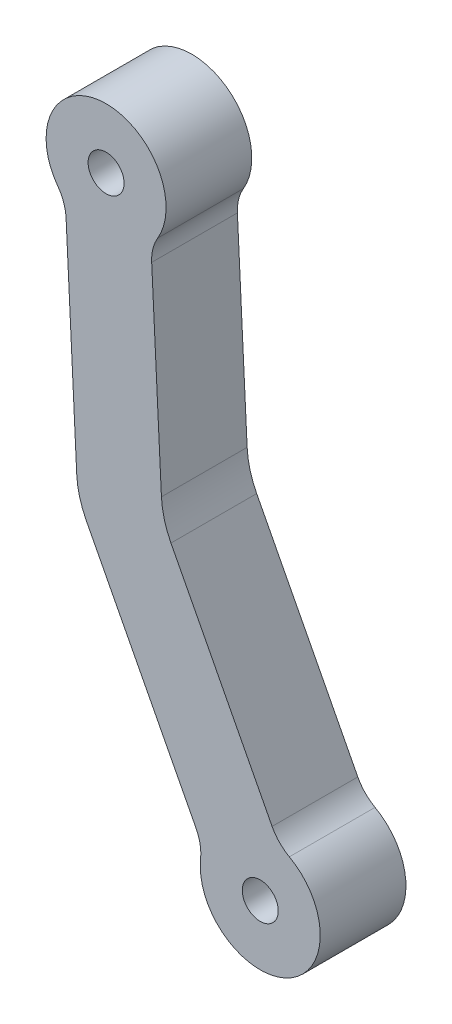
ISO-10303-21;
HEADER;
FILE_DESCRIPTION(('STEP AP214'),'2;1');
FILE_NAME('part.step','',(''),(''),'','','');
FILE_SCHEMA(('AUTOMOTIVE_DESIGN { 1 0 10303 214 1 1 1 1 }'));
ENDSEC;
DATA;
#1=APPLICATION_CONTEXT('core data for automotive mechanical design processes');
#2=APPLICATION_PROTOCOL_DEFINITION('international standard','automotive_design',2000,#1);
#3=PRODUCT_CONTEXT('',#1,'mechanical');
#4=PRODUCT('Part','Part','',(#3));
#5=PRODUCT_RELATED_PRODUCT_CATEGORY('part','',(#4));
#6=PRODUCT_DEFINITION_FORMATION('','',#4);
#7=PRODUCT_DEFINITION_CONTEXT('part definition',#1,'design');
#8=PRODUCT_DEFINITION('design','',#6,#7);
#9=PRODUCT_DEFINITION_SHAPE('','',#8);
#10=(LENGTH_UNIT() NAMED_UNIT(*) SI_UNIT(.MILLI.,.METRE.));
#11=(NAMED_UNIT(*) PLANE_ANGLE_UNIT() SI_UNIT($,.RADIAN.));
#12=(NAMED_UNIT(*) SI_UNIT($,.STERADIAN.) SOLID_ANGLE_UNIT());
#13=UNCERTAINTY_MEASURE_WITH_UNIT(LENGTH_MEASURE(1.E-05),#10,'distance_accuracy_value','');
#14=(GEOMETRIC_REPRESENTATION_CONTEXT(3) GLOBAL_UNCERTAINTY_ASSIGNED_CONTEXT((#13)) GLOBAL_UNIT_ASSIGNED_CONTEXT((#10,
#11,#12)) REPRESENTATION_CONTEXT('',''));
#15=CARTESIAN_POINT('',(0.,0.,0.));
#16=DIRECTION('',(0.,0.,1.));
#17=DIRECTION('',(1.,0.,0.));
#18=AXIS2_PLACEMENT_3D('',#15,#16,#17);
#19=CARTESIAN_POINT('',(-45.067,-17.7,10.));
#20=DIRECTION('',(0.,0.,1.));
#21=DIRECTION('',(1.,0.,0.));
#22=AXIS2_PLACEMENT_3D('',#19,#20,#21);
#23=PLANE('',#22);
#24=CARTESIAN_POINT('',(-45.067,-17.7,10.));
#25=DIRECTION('',(0.,0.,1.));
#26=DIRECTION('',(1.,0.,0.));
#27=AXIS2_PLACEMENT_3D('',#24,#25,#26);
#28=CIRCLE('',#27,2.1);
#29=CARTESIAN_POINT('',(-42.967,-17.7,10.));
#30=VERTEX_POINT('',#29);
#31=EDGE_CURVE('E162',#30,#30,#28,.T.);
#32=ORIENTED_EDGE('',*,*,#31,.F.);
#33=EDGE_LOOP('',(#32));
#34=FACE_BOUND('',#33,.T.);
#35=CARTESIAN_POINT('',(-45.067,-17.7,10.));
#36=DIRECTION('',(0.,0.,1.));
#37=DIRECTION('',(1.,0.,0.));
#38=AXIS2_PLACEMENT_3D('',#35,#36,#37);
#39=CIRCLE('',#38,6.99999999999999);
#40=CARTESIAN_POINT('',(-52.0270499023951,-16.9532032698453,10.));
#41=VERTEX_POINT('',#40);
#42=CARTESIAN_POINT('',(-41.6723017328103,-11.5782336148184,10.));
#43=VERTEX_POINT('',#42);
#44=EDGE_CURVE('E181',#41,#43,#39,.T.);
#45=ORIENTED_EDGE('',*,*,#44,.T.);
#46=CARTESIAN_POINT('',(-39.2475172562462,-7.20554333968861,10.));
#47=DIRECTION('',(0.,0.,-1.));
#48=DIRECTION('',(1.,0.,0.));
#49=AXIS2_PLACEMENT_3D('',#46,#47,#48);
#50=CIRCLE('',#49,5.00000000000009);
#51=CARTESIAN_POINT('',(-43.6852664812232,-9.50910185125652,10.));
#52=VERTEX_POINT('',#51);
#53=EDGE_CURVE('E109',#43,#52,#50,.T.);
#54=ORIENTED_EDGE('',*,*,#53,.T.);
#55=DIRECTION('',(-0.460711702313574,0.887549844995383,0.));
#56=VECTOR('',#55,1.);
#57=CARTESIAN_POINT('',(-43.6852664812232,-9.50910185125652,10.));
#58=LINE('',#57,#56);
#59=CARTESIAN_POINT('',(-55.4849486944537,13.2226978116472,10.));
#60=VERTEX_POINT('',#59);
#61=EDGE_CURVE('E208',#52,#60,#58,.T.);
#62=ORIENTED_EDGE('',*,*,#61,.T.);
#63=CARTESIAN_POINT('',(-46.6094502445001,17.8298148347829,10.));
#64=DIRECTION('',(0.,0.,-1.));
#65=DIRECTION('',(1.,0.,0.));
#66=AXIS2_PLACEMENT_3D('',#63,#64,#65);
#67=CIRCLE('',#66,9.99999999999982);
#68=CARTESIAN_POINT('',(-56.5973879653498,17.3387954009265,10.));
#69=VERTEX_POINT('',#68);
#70=EDGE_CURVE('E227',#60,#69,#67,.T.);
#71=ORIENTED_EDGE('',*,*,#70,.T.);
#72=DIRECTION('',(-0.0491019433856402,0.998793772084985,0.));
#73=VECTOR('',#72,1.);
#74=CARTESIAN_POINT('',(-56.5973879653498,17.3387954009265,10.));
#75=LINE('',#74,#73);
#76=CARTESIAN_POINT('',(-57.7340925822037,40.4607619409709,10.));
#77=VERTEX_POINT('',#76);
#78=EDGE_CURVE('E224',#69,#77,#75,.T.);
#79=ORIENTED_EDGE('',*,*,#78,.T.);
#80=CARTESIAN_POINT('',(-52.7401237217787,40.7062716578991,10.));
#81=DIRECTION('',(0.,0.,-1.));
#82=DIRECTION('',(1.,0.,0.));
#83=AXIS2_PLACEMENT_3D('',#80,#81,#82);
#84=CIRCLE('',#83,5.00000000000008);
#85=CARTESIAN_POINT('',(-57.0374750410391,43.2622003812503,10.));
#86=VERTEX_POINT('',#85);
#87=EDGE_CURVE('E226',#77,#86,#84,.T.);
#88=ORIENTED_EDGE('',*,*,#87,.T.);
#89=CARTESIAN_POINT('',(-63.0537668880036,46.8405005939419,10.));
#90=DIRECTION('',(0.,0.,1.));
#91=DIRECTION('',(1.,0.,0.));
#92=AXIS2_PLACEMENT_3D('',#89,#90,#91);
#93=CIRCLE('',#92,6.99999999999998);
#94=CARTESIAN_POINT('',(-68.6900692357354,42.6893446290386,10.));
#95=VERTEX_POINT('',#94);
#96=EDGE_CURVE('E229',#86,#95,#93,.T.);
#97=ORIENTED_EDGE('',*,*,#96,.T.);
#98=CARTESIAN_POINT('',(-72.7159991634786,39.7242327901862,10.));
#99=DIRECTION('',(0.,0.,-1.));
#100=DIRECTION('',(1.,0.,0.));
#101=AXIS2_PLACEMENT_3D('',#98,#99,#100);
#102=CIRCLE('',#101,5.00000000000009);
#103=CARTESIAN_POINT('',(-67.7220303030536,39.9697425071145,10.));
#104=VERTEX_POINT('',#103);
#105=EDGE_CURVE('E235',#95,#104,#102,.T.);
#106=ORIENTED_EDGE('',*,*,#105,.T.);
#107=DIRECTION('',(0.0491019433856435,-0.998793772084985,0.));
#108=VECTOR('',#107,1.);
#109=CARTESIAN_POINT('',(-67.7220303030536,39.9697425071145,10.));
#110=LINE('',#109,#108);
#111=CARTESIAN_POINT('',(-66.4781827515993,14.6683572226584,10.));
#112=VERTEX_POINT('',#111);
#113=EDGE_CURVE('E140',#104,#112,#110,.T.);
#114=ORIENTED_EDGE('',*,*,#113,.T.);
#115=CARTESIAN_POINT('',(-56.4902450307499,15.1593766565147,10.));
#116=DIRECTION('',(0.,0.,1.));
#117=DIRECTION('',(1.,0.,0.));
#118=AXIS2_PLACEMENT_3D('',#115,#116,#117);
#119=CIRCLE('',#118,9.99999999999954);
#120=CARTESIAN_POINT('',(-65.3657434807033,10.5522596333791,10.));
#121=VERTEX_POINT('',#120);
#122=EDGE_CURVE('E134',#112,#121,#119,.T.);
#123=ORIENTED_EDGE('',*,*,#122,.T.);
#124=DIRECTION('',(0.460711702313577,-0.887549844995381,0.));
#125=VECTOR('',#124,1.);
#126=CARTESIAN_POINT('',(-65.3657434807033,10.5522596333791,10.));
#127=LINE('',#126,#125);
#128=CARTESIAN_POINT('',(-52.560764931177,-14.1162188743923,10.));
#129=VERTEX_POINT('',#128);
#130=EDGE_CURVE('E138',#121,#129,#127,.T.);
#131=ORIENTED_EDGE('',*,*,#130,.T.);
#132=CARTESIAN_POINT('',(-56.9985141561539,-16.4197773859602,10.));
#133=DIRECTION('',(0.,0.,-1.));
#134=DIRECTION('',(1.,0.,0.));
#135=AXIS2_PLACEMENT_3D('',#132,#133,#134);
#136=CIRCLE('',#135,5.00000000000001);
#137=EDGE_CURVE('E54',#129,#41,#136,.T.);
#138=ORIENTED_EDGE('',*,*,#137,.T.);
#139=EDGE_LOOP('',(#45,#54,#62,#71,#79,#88,#97,#106,#114,#123,#131,#138));
#140=FACE_BOUND('',#139,.T.);
#141=CARTESIAN_POINT('',(-63.0537668880036,46.8405005939419,10.));
#142=DIRECTION('',(0.,0.,1.));
#143=DIRECTION('',(1.,0.,0.));
#144=AXIS2_PLACEMENT_3D('',#141,#142,#143);
#145=CIRCLE('',#144,2.1);
#146=CARTESIAN_POINT('',(-60.9537668880036,46.8405005939419,10.));
#147=VERTEX_POINT('',#146);
#148=EDGE_CURVE('E277',#147,#147,#145,.T.);
#149=ORIENTED_EDGE('',*,*,#148,.F.);
#150=EDGE_LOOP('',(#149));
#151=FACE_BOUND('',#150,.T.);
#152=ADVANCED_FACE('F37',(#34,#140,#151),#23,.T.);
#153=CARTESIAN_POINT('',(-45.067,-17.7,0.));
#154=DIRECTION('',(0.,0.,1.));
#155=DIRECTION('',(1.,0.,0.));
#156=AXIS2_PLACEMENT_3D('',#153,#154,#155);
#157=PLANE('',#156);
#158=CARTESIAN_POINT('',(-45.067,-17.7,0.));
#159=DIRECTION('',(0.,0.,1.));
#160=DIRECTION('',(1.,0.,0.));
#161=AXIS2_PLACEMENT_3D('',#158,#159,#160);
#162=CIRCLE('',#161,6.99999999999999);
#163=CARTESIAN_POINT('',(-52.0270499023951,-16.9532032698453,0.));
#164=VERTEX_POINT('',#163);
#165=CARTESIAN_POINT('',(-41.6723017328103,-11.5782336148184,0.));
#166=VERTEX_POINT('',#165);
#167=EDGE_CURVE('E158',#164,#166,#162,.T.);
#168=ORIENTED_EDGE('',*,*,#167,.F.);
#169=CARTESIAN_POINT('',(-56.9985141561539,-16.4197773859602,0.));
#170=DIRECTION('',(0.,0.,-1.));
#171=DIRECTION('',(1.,0.,0.));
#172=AXIS2_PLACEMENT_3D('',#169,#170,#171);
#173=CIRCLE('',#172,5.00000000000001);
#174=CARTESIAN_POINT('',(-52.560764931177,-14.1162188743923,0.));
#175=VERTEX_POINT('',#174);
#176=EDGE_CURVE('E101',#175,#164,#173,.T.);
#177=ORIENTED_EDGE('',*,*,#176,.F.);
#178=DIRECTION('',(0.460711702313577,-0.887549844995381,0.));
#179=VECTOR('',#178,1.);
#180=CARTESIAN_POINT('',(-65.3657434807033,10.5522596333791,0.));
#181=LINE('',#180,#179);
#182=CARTESIAN_POINT('',(-65.3657434807033,10.5522596333791,0.));
#183=VERTEX_POINT('',#182);
#184=EDGE_CURVE('E95',#183,#175,#181,.T.);
#185=ORIENTED_EDGE('',*,*,#184,.F.);
#186=CARTESIAN_POINT('',(-56.4902450307499,15.1593766565147,0.));
#187=DIRECTION('',(0.,0.,1.));
#188=DIRECTION('',(1.,0.,0.));
#189=AXIS2_PLACEMENT_3D('',#186,#187,#188);
#190=CIRCLE('',#189,9.99999999999954);
#191=CARTESIAN_POINT('',(-66.4781827515993,14.6683572226584,0.));
#192=VERTEX_POINT('',#191);
#193=EDGE_CURVE('E148',#192,#183,#190,.T.);
#194=ORIENTED_EDGE('',*,*,#193,.F.);
#195=DIRECTION('',(0.0491019433856435,-0.998793772084985,0.));
#196=VECTOR('',#195,1.);
#197=CARTESIAN_POINT('',(-67.7220303030536,39.9697425071145,0.));
#198=LINE('',#197,#196);
#199=CARTESIAN_POINT('',(-67.7220303030536,39.9697425071145,0.));
#200=VERTEX_POINT('',#199);
#201=EDGE_CURVE('E176',#200,#192,#198,.T.);
#202=ORIENTED_EDGE('',*,*,#201,.F.);
#203=CARTESIAN_POINT('',(-72.7159991634786,39.7242327901862,0.));
#204=DIRECTION('',(0.,0.,-1.));
#205=DIRECTION('',(1.,0.,0.));
#206=AXIS2_PLACEMENT_3D('',#203,#204,#205);
#207=CIRCLE('',#206,5.00000000000009);
#208=CARTESIAN_POINT('',(-68.6900692357354,42.6893446290386,0.));
#209=VERTEX_POINT('',#208);
#210=EDGE_CURVE('E174',#209,#200,#207,.T.);
#211=ORIENTED_EDGE('',*,*,#210,.F.);
#212=CARTESIAN_POINT('',(-63.0537668880036,46.8405005939419,0.));
#213=DIRECTION('',(0.,0.,1.));
#214=DIRECTION('',(1.,0.,0.));
#215=AXIS2_PLACEMENT_3D('',#212,#213,#214);
#216=CIRCLE('',#215,6.99999999999998);
#217=CARTESIAN_POINT('',(-57.0374750410391,43.2622003812503,0.));
#218=VERTEX_POINT('',#217);
#219=EDGE_CURVE('E172',#218,#209,#216,.T.);
#220=ORIENTED_EDGE('',*,*,#219,.F.);
#221=CARTESIAN_POINT('',(-52.7401237217787,40.7062716578991,0.));
#222=DIRECTION('',(0.,0.,-1.));
#223=DIRECTION('',(1.,0.,0.));
#224=AXIS2_PLACEMENT_3D('',#221,#222,#223);
#225=CIRCLE('',#224,5.00000000000008);
#226=CARTESIAN_POINT('',(-57.7340925822037,40.4607619409709,0.));
#227=VERTEX_POINT('',#226);
#228=EDGE_CURVE('E170',#227,#218,#225,.T.);
#229=ORIENTED_EDGE('',*,*,#228,.F.);
#230=DIRECTION('',(-0.0491019433856402,0.998793772084985,0.));
#231=VECTOR('',#230,1.);
#232=CARTESIAN_POINT('',(-56.5973879653498,17.3387954009265,0.));
#233=LINE('',#232,#231);
#234=CARTESIAN_POINT('',(-56.5973879653498,17.3387954009265,0.));
#235=VERTEX_POINT('',#234);
#236=EDGE_CURVE('E168',#235,#227,#233,.T.);
#237=ORIENTED_EDGE('',*,*,#236,.F.);
#238=CARTESIAN_POINT('',(-46.6094502445001,17.8298148347829,0.));
#239=DIRECTION('',(0.,0.,-1.));
#240=DIRECTION('',(1.,0.,0.));
#241=AXIS2_PLACEMENT_3D('',#238,#239,#240);
#242=CIRCLE('',#241,9.99999999999982);
#243=CARTESIAN_POINT('',(-55.4849486944537,13.2226978116472,0.));
#244=VERTEX_POINT('',#243);
#245=EDGE_CURVE('E166',#244,#235,#242,.T.);
#246=ORIENTED_EDGE('',*,*,#245,.F.);
#247=DIRECTION('',(-0.460711702313574,0.887549844995383,0.));
#248=VECTOR('',#247,1.);
#249=CARTESIAN_POINT('',(-43.6852664812232,-9.50910185125652,0.));
#250=LINE('',#249,#248);
#251=CARTESIAN_POINT('',(-43.6852664812232,-9.50910185125652,0.));
#252=VERTEX_POINT('',#251);
#253=EDGE_CURVE('E164',#252,#244,#250,.T.);
#254=ORIENTED_EDGE('',*,*,#253,.F.);
#255=CARTESIAN_POINT('',(-39.2475172562462,-7.20554333968861,0.));
#256=DIRECTION('',(0.,0.,-1.));
#257=DIRECTION('',(1.,0.,0.));
#258=AXIS2_PLACEMENT_3D('',#255,#256,#257);
#259=CIRCLE('',#258,5.00000000000009);
#260=EDGE_CURVE('E161',#166,#252,#259,.T.);
#261=ORIENTED_EDGE('',*,*,#260,.F.);
#262=EDGE_LOOP('',(#168,#177,#185,#194,#202,#211,#220,#229,#237,#246,#254,#261));
#263=FACE_BOUND('',#262,.T.);
#264=CARTESIAN_POINT('',(-45.067,-17.7,0.));
#265=DIRECTION('',(0.,0.,1.));
#266=DIRECTION('',(1.,0.,0.));
#267=AXIS2_PLACEMENT_3D('',#264,#265,#266);
#268=CIRCLE('',#267,2.1);
#269=CARTESIAN_POINT('',(-42.967,-17.7,0.));
#270=VERTEX_POINT('',#269);
#271=EDGE_CURVE('E283',#270,#270,#268,.T.);
#272=ORIENTED_EDGE('',*,*,#271,.T.);
#273=EDGE_LOOP('',(#272));
#274=FACE_BOUND('',#273,.T.);
#275=CARTESIAN_POINT('',(-63.0537668880036,46.8405005939419,0.));
#276=DIRECTION('',(0.,0.,1.));
#277=DIRECTION('',(1.,0.,0.));
#278=AXIS2_PLACEMENT_3D('',#275,#276,#277);
#279=CIRCLE('',#278,2.1);
#280=CARTESIAN_POINT('',(-60.9537668880036,46.8405005939419,0.));
#281=VERTEX_POINT('',#280);
#282=EDGE_CURVE('E280',#281,#281,#279,.T.);
#283=ORIENTED_EDGE('',*,*,#282,.T.);
#284=EDGE_LOOP('',(#283));
#285=FACE_BOUND('',#284,.T.);
#286=ADVANCED_FACE('F212',(#263,#274,#285),#157,.F.);
#287=CARTESIAN_POINT('',(-45.067,-17.7,10.));
#288=DIRECTION('',(0.,0.,-1.));
#289=DIRECTION('',(-1.,0.,0.));
#290=AXIS2_PLACEMENT_3D('',#287,#288,#289);
#291=CYLINDRICAL_SURFACE('',#290,6.99999999999999);
#292=ORIENTED_EDGE('',*,*,#167,.T.);
#293=DIRECTION('',(0.,0.,-1.));
#294=VECTOR('',#293,1.);
#295=CARTESIAN_POINT('',(-41.6723017328103,-11.5782336148184,10.));
#296=LINE('',#295,#294);
#297=EDGE_CURVE('E11',#43,#166,#296,.T.);
#298=ORIENTED_EDGE('',*,*,#297,.F.);
#299=ORIENTED_EDGE('',*,*,#44,.F.);
#300=DIRECTION('',(0.,0.,-1.));
#301=VECTOR('',#300,1.);
#302=CARTESIAN_POINT('',(-52.0270499023951,-16.9532032698453,10.));
#303=LINE('',#302,#301);
#304=EDGE_CURVE('E154',#41,#164,#303,.T.);
#305=ORIENTED_EDGE('',*,*,#304,.T.);
#306=EDGE_LOOP('',(#292,#298,#299,#305));
#307=FACE_BOUND('',#306,.T.);
#308=ADVANCED_FACE('F39',(#307),#291,.T.);
#309=CARTESIAN_POINT('',(-39.2475172562462,-7.20554333968861,10.));
#310=DIRECTION('',(0.,0.,-1.));
#311=DIRECTION('',(-1.,0.,0.));
#312=AXIS2_PLACEMENT_3D('',#309,#310,#311);
#313=CYLINDRICAL_SURFACE('',#312,5.00000000000009);
#314=ORIENTED_EDGE('',*,*,#260,.T.);
#315=DIRECTION('',(0.,0.,-1.));
#316=VECTOR('',#315,1.);
#317=CARTESIAN_POINT('',(-43.6852664812232,-9.50910185125652,10.));
#318=LINE('',#317,#316);
#319=EDGE_CURVE('E46',#52,#252,#318,.T.);
#320=ORIENTED_EDGE('',*,*,#319,.F.);
#321=ORIENTED_EDGE('',*,*,#53,.F.);
#322=ORIENTED_EDGE('',*,*,#297,.T.);
#323=EDGE_LOOP('',(#314,#320,#321,#322));
#324=FACE_BOUND('',#323,.T.);
#325=ADVANCED_FACE('F386',(#324),#313,.F.);
#326=CARTESIAN_POINT('',(-43.6852664812232,-9.50910185125652,10.));
#327=DIRECTION('',(-0.887549844995383,-0.460711702313574,0.));
#328=DIRECTION('',(0.460711702313574,-0.887549844995383,0.));
#329=AXIS2_PLACEMENT_3D('',#326,#327,#328);
#330=PLANE('',#329);
#331=ORIENTED_EDGE('',*,*,#253,.T.);
#332=DIRECTION('',(0.,0.,-1.));
#333=VECTOR('',#332,1.);
#334=CARTESIAN_POINT('',(-55.4849486944537,13.2226978116472,10.));
#335=LINE('',#334,#333);
#336=EDGE_CURVE('E200',#60,#244,#335,.T.);
#337=ORIENTED_EDGE('',*,*,#336,.F.);
#338=ORIENTED_EDGE('',*,*,#61,.F.);
#339=ORIENTED_EDGE('',*,*,#319,.T.);
#340=EDGE_LOOP('',(#331,#337,#338,#339));
#341=FACE_BOUND('',#340,.T.);
#342=ADVANCED_FACE('F206',(#341),#330,.F.);
#343=CARTESIAN_POINT('',(-46.6094502445001,17.8298148347829,10.));
#344=DIRECTION('',(0.,0.,-1.));
#345=DIRECTION('',(-1.,0.,0.));
#346=AXIS2_PLACEMENT_3D('',#343,#344,#345);
#347=CYLINDRICAL_SURFACE('',#346,9.99999999999982);
#348=ORIENTED_EDGE('',*,*,#245,.T.);
#349=DIRECTION('',(0.,0.,-1.));
#350=VECTOR('',#349,1.);
#351=CARTESIAN_POINT('',(-56.5973879653498,17.3387954009265,10.));
#352=LINE('',#351,#350);
#353=EDGE_CURVE('E197',#69,#235,#352,.T.);
#354=ORIENTED_EDGE('',*,*,#353,.F.);
#355=ORIENTED_EDGE('',*,*,#70,.F.);
#356=ORIENTED_EDGE('',*,*,#336,.T.);
#357=EDGE_LOOP('',(#348,#354,#355,#356));
#358=FACE_BOUND('',#357,.T.);
#359=ADVANCED_FACE('F218',(#358),#347,.F.);
#360=CARTESIAN_POINT('',(-56.5973879653498,17.3387954009265,10.));
#361=DIRECTION('',(-0.998793772084985,-0.0491019433856402,0.));
#362=DIRECTION('',(0.0491019433856402,-0.998793772084985,0.));
#363=AXIS2_PLACEMENT_3D('',#360,#361,#362);
#364=PLANE('',#363);
#365=ORIENTED_EDGE('',*,*,#236,.T.);
#366=DIRECTION('',(0.,0.,-1.));
#367=VECTOR('',#366,1.);
#368=CARTESIAN_POINT('',(-57.7340925822037,40.4607619409709,10.));
#369=LINE('',#368,#367);
#370=EDGE_CURVE('E194',#77,#227,#369,.T.);
#371=ORIENTED_EDGE('',*,*,#370,.F.);
#372=ORIENTED_EDGE('',*,*,#78,.F.);
#373=ORIENTED_EDGE('',*,*,#353,.T.);
#374=EDGE_LOOP('',(#365,#371,#372,#373));
#375=FACE_BOUND('',#374,.T.);
#376=ADVANCED_FACE('F222',(#375),#364,.F.);
#377=CARTESIAN_POINT('',(-52.7401237217787,40.7062716578991,10.));
#378=DIRECTION('',(0.,0.,-1.));
#379=DIRECTION('',(-1.,0.,0.));
#380=AXIS2_PLACEMENT_3D('',#377,#378,#379);
#381=CYLINDRICAL_SURFACE('',#380,5.00000000000008);
#382=ORIENTED_EDGE('',*,*,#228,.T.);
#383=DIRECTION('',(0.,0.,-1.));
#384=VECTOR('',#383,1.);
#385=CARTESIAN_POINT('',(-57.0374750410391,43.2622003812503,10.));
#386=LINE('',#385,#384);
#387=EDGE_CURVE('E191',#86,#218,#386,.T.);
#388=ORIENTED_EDGE('',*,*,#387,.F.);
#389=ORIENTED_EDGE('',*,*,#87,.F.);
#390=ORIENTED_EDGE('',*,*,#370,.T.);
#391=EDGE_LOOP('',(#382,#388,#389,#390));
#392=FACE_BOUND('',#391,.T.);
#393=ADVANCED_FACE('F347',(#392),#381,.F.);
#394=CARTESIAN_POINT('',(-63.0537668880036,46.8405005939419,10.));
#395=DIRECTION('',(0.,0.,-1.));
#396=DIRECTION('',(-1.,0.,0.));
#397=AXIS2_PLACEMENT_3D('',#394,#395,#396);
#398=CYLINDRICAL_SURFACE('',#397,6.99999999999998);
#399=ORIENTED_EDGE('',*,*,#219,.T.);
#400=DIRECTION('',(0.,0.,-1.));
#401=VECTOR('',#400,1.);
#402=CARTESIAN_POINT('',(-68.6900692357354,42.6893446290386,10.));
#403=LINE('',#402,#401);
#404=EDGE_CURVE('E188',#95,#209,#403,.T.);
#405=ORIENTED_EDGE('',*,*,#404,.F.);
#406=ORIENTED_EDGE('',*,*,#96,.F.);
#407=ORIENTED_EDGE('',*,*,#387,.T.);
#408=EDGE_LOOP('',(#399,#405,#406,#407));
#409=FACE_BOUND('',#408,.T.);
#410=ADVANCED_FACE('F337',(#409),#398,.T.);
#411=CARTESIAN_POINT('',(-72.7159991634786,39.7242327901862,10.));
#412=DIRECTION('',(0.,0.,-1.));
#413=DIRECTION('',(-1.,0.,0.));
#414=AXIS2_PLACEMENT_3D('',#411,#412,#413);
#415=CYLINDRICAL_SURFACE('',#414,5.00000000000009);
#416=ORIENTED_EDGE('',*,*,#210,.T.);
#417=DIRECTION('',(0.,0.,-1.));
#418=VECTOR('',#417,1.);
#419=CARTESIAN_POINT('',(-67.7220303030536,39.9697425071145,10.));
#420=LINE('',#419,#418);
#421=EDGE_CURVE('E185',#104,#200,#420,.T.);
#422=ORIENTED_EDGE('',*,*,#421,.F.);
#423=ORIENTED_EDGE('',*,*,#105,.F.);
#424=ORIENTED_EDGE('',*,*,#404,.T.);
#425=EDGE_LOOP('',(#416,#422,#423,#424));
#426=FACE_BOUND('',#425,.T.);
#427=ADVANCED_FACE('F241',(#426),#415,.F.);
#428=CARTESIAN_POINT('',(-67.7220303030536,39.9697425071145,10.));
#429=DIRECTION('',(0.998793772084985,0.0491019433856435,0.));
#430=DIRECTION('',(-0.0491019433856435,0.998793772084985,0.));
#431=AXIS2_PLACEMENT_3D('',#428,#429,#430);
#432=PLANE('',#431);
#433=ORIENTED_EDGE('',*,*,#201,.T.);
#434=DIRECTION('',(0.,0.,-1.));
#435=VECTOR('',#434,1.);
#436=CARTESIAN_POINT('',(-66.4781827515993,14.6683572226584,10.));
#437=LINE('',#436,#435);
#438=EDGE_CURVE('E149',#112,#192,#437,.T.);
#439=ORIENTED_EDGE('',*,*,#438,.F.);
#440=ORIENTED_EDGE('',*,*,#113,.F.);
#441=ORIENTED_EDGE('',*,*,#421,.T.);
#442=EDGE_LOOP('',(#433,#439,#440,#441));
#443=FACE_BOUND('',#442,.T.);
#444=ADVANCED_FACE('F245',(#443),#432,.F.);
#445=CARTESIAN_POINT('',(-56.4902450307499,15.1593766565147,10.));
#446=DIRECTION('',(0.,0.,-1.));
#447=DIRECTION('',(-1.,0.,0.));
#448=AXIS2_PLACEMENT_3D('',#445,#446,#447);
#449=CYLINDRICAL_SURFACE('',#448,9.99999999999954);
#450=ORIENTED_EDGE('',*,*,#193,.T.);
#451=DIRECTION('',(0.,0.,-1.));
#452=VECTOR('',#451,1.);
#453=CARTESIAN_POINT('',(-65.3657434807033,10.5522596333791,10.));
#454=LINE('',#453,#452);
#455=EDGE_CURVE('E145',#121,#183,#454,.T.);
#456=ORIENTED_EDGE('',*,*,#455,.F.);
#457=ORIENTED_EDGE('',*,*,#122,.F.);
#458=ORIENTED_EDGE('',*,*,#438,.T.);
#459=EDGE_LOOP('',(#450,#456,#457,#458));
#460=FACE_BOUND('',#459,.T.);
#461=ADVANCED_FACE('F146',(#460),#449,.T.);
#462=CARTESIAN_POINT('',(-65.3657434807033,10.5522596333791,10.));
#463=DIRECTION('',(0.887549844995382,0.460711702313577,0.));
#464=DIRECTION('',(-0.460711702313577,0.887549844995382,0.));
#465=AXIS2_PLACEMENT_3D('',#462,#463,#464);
#466=PLANE('',#465);
#467=ORIENTED_EDGE('',*,*,#184,.T.);
#468=DIRECTION('',(0.,0.,-1.));
#469=VECTOR('',#468,1.);
#470=CARTESIAN_POINT('',(-52.560764931177,-14.1162188743923,10.));
#471=LINE('',#470,#469);
#472=EDGE_CURVE('E150',#129,#175,#471,.T.);
#473=ORIENTED_EDGE('',*,*,#472,.F.);
#474=ORIENTED_EDGE('',*,*,#130,.F.);
#475=ORIENTED_EDGE('',*,*,#455,.T.);
#476=EDGE_LOOP('',(#467,#473,#474,#475));
#477=FACE_BOUND('',#476,.T.);
#478=ADVANCED_FACE('F152',(#477),#466,.F.);
#479=CARTESIAN_POINT('',(-56.9985141561539,-16.4197773859602,10.));
#480=DIRECTION('',(0.,0.,-1.));
#481=DIRECTION('',(-1.,0.,0.));
#482=AXIS2_PLACEMENT_3D('',#479,#480,#481);
#483=CYLINDRICAL_SURFACE('',#482,5.00000000000001);
#484=ORIENTED_EDGE('',*,*,#176,.T.);
#485=ORIENTED_EDGE('',*,*,#304,.F.);
#486=ORIENTED_EDGE('',*,*,#137,.F.);
#487=ORIENTED_EDGE('',*,*,#472,.T.);
#488=EDGE_LOOP('',(#484,#485,#486,#487));
#489=FACE_BOUND('',#488,.T.);
#490=ADVANCED_FACE('F249',(#489),#483,.F.);
#491=CARTESIAN_POINT('',(-45.067,-17.7,10.));
#492=DIRECTION('',(0.,0.,-1.));
#493=DIRECTION('',(-1.,0.,0.));
#494=AXIS2_PLACEMENT_3D('',#491,#492,#493);
#495=CYLINDRICAL_SURFACE('',#494,2.1);
#496=ORIENTED_EDGE('',*,*,#31,.T.);
#497=EDGE_LOOP('',(#496));
#498=FACE_BOUND('',#497,.T.);
#499=ORIENTED_EDGE('',*,*,#271,.F.);
#500=EDGE_LOOP('',(#499));
#501=FACE_BOUND('',#500,.T.);
#502=ADVANCED_FACE('F251',(#498,#501),#495,.F.);
#503=CARTESIAN_POINT('',(-63.0537668880036,46.8405005939419,10.));
#504=DIRECTION('',(0.,0.,-1.));
#505=DIRECTION('',(-1.,0.,0.));
#506=AXIS2_PLACEMENT_3D('',#503,#504,#505);
#507=CYLINDRICAL_SURFACE('',#506,2.1);
#508=ORIENTED_EDGE('',*,*,#148,.T.);
#509=EDGE_LOOP('',(#508));
#510=FACE_BOUND('',#509,.T.);
#511=ORIENTED_EDGE('',*,*,#282,.F.);
#512=EDGE_LOOP('',(#511));
#513=FACE_BOUND('',#512,.T.);
#514=ADVANCED_FACE('F257',(#510,#513),#507,.F.);
#515=CLOSED_SHELL('',(#152,#286,#308,#325,#342,#359,#376,#393,#410,#427,#444,#461,#478,#490,
#502,#514));
#516=MANIFOLD_SOLID_BREP('B2',#515);
#517=ADVANCED_BREP_SHAPE_REPRESENTATION('',(#18,#516),#14);
#518=SHAPE_DEFINITION_REPRESENTATION(#9,#517);
ENDSEC;
END-ISO-10303-21;
